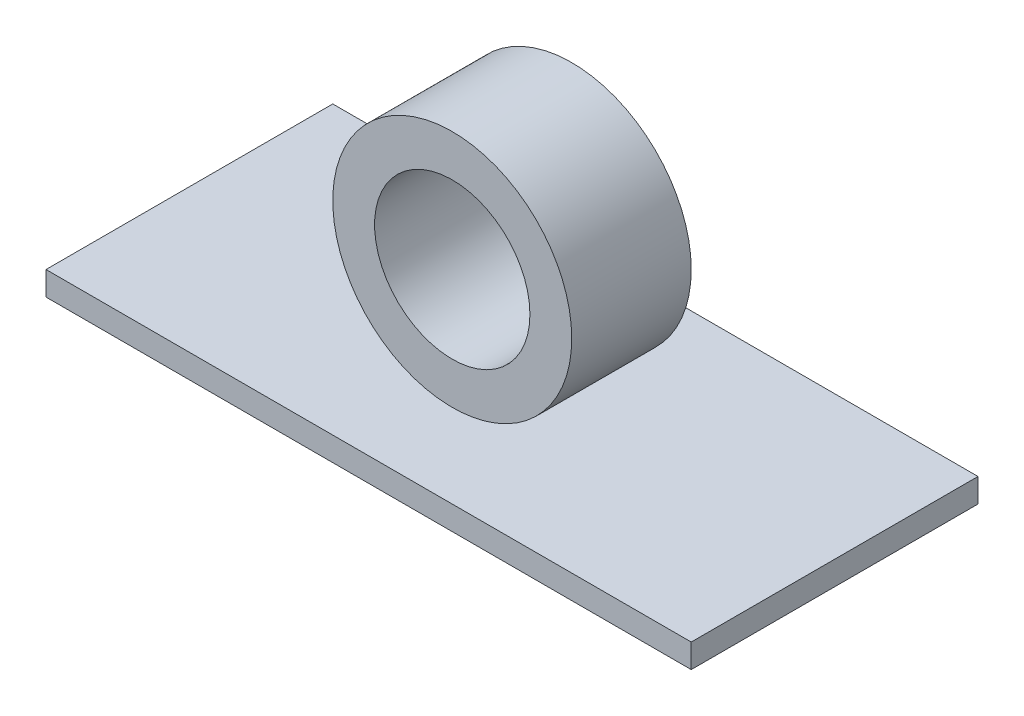
ISO-10303-21;
HEADER;
FILE_DESCRIPTION(('STEP AP214'),'2;1');
FILE_NAME('part.step','',(''),(''),'','','');
FILE_SCHEMA(('AUTOMOTIVE_DESIGN { 1 0 10303 214 1 1 1 1 }'));
ENDSEC;
DATA;
#1=APPLICATION_CONTEXT('core data for automotive mechanical design processes');
#2=APPLICATION_PROTOCOL_DEFINITION('international standard','automotive_design',2000,#1);
#3=PRODUCT_CONTEXT('',#1,'mechanical');
#4=PRODUCT('Part','Part','',(#3));
#5=PRODUCT_RELATED_PRODUCT_CATEGORY('part','',(#4));
#6=PRODUCT_DEFINITION_FORMATION('','',#4);
#7=PRODUCT_DEFINITION_CONTEXT('part definition',#1,'design');
#8=PRODUCT_DEFINITION('design','',#6,#7);
#9=PRODUCT_DEFINITION_SHAPE('','',#8);
#10=(LENGTH_UNIT() NAMED_UNIT(*) SI_UNIT(.MILLI.,.METRE.));
#11=(NAMED_UNIT(*) PLANE_ANGLE_UNIT() SI_UNIT($,.RADIAN.));
#12=(NAMED_UNIT(*) SI_UNIT($,.STERADIAN.) SOLID_ANGLE_UNIT());
#13=UNCERTAINTY_MEASURE_WITH_UNIT(LENGTH_MEASURE(1.E-05),#10,'distance_accuracy_value','');
#14=(GEOMETRIC_REPRESENTATION_CONTEXT(3) GLOBAL_UNCERTAINTY_ASSIGNED_CONTEXT((#13)) GLOBAL_UNIT_ASSIGNED_CONTEXT((#10,
#11,#12)) REPRESENTATION_CONTEXT('',''));
#15=CARTESIAN_POINT('',(0.,0.,0.));
#16=DIRECTION('',(0.,0.,1.));
#17=DIRECTION('',(1.,0.,0.));
#18=AXIS2_PLACEMENT_3D('',#15,#16,#17);
#19=CARTESIAN_POINT('',(0.,12.,5.));
#20=DIRECTION('',(0.,0.,1.));
#21=DIRECTION('',(1.,0.,0.));
#22=AXIS2_PLACEMENT_3D('',#19,#20,#21);
#23=PLANE('',#22);
#24=CARTESIAN_POINT('',(0.,12.,5.));
#25=DIRECTION('',(0.,0.,1.));
#26=DIRECTION('',(1.,0.,0.));
#27=AXIS2_PLACEMENT_3D('',#24,#25,#26);
#28=CIRCLE('',#27,10.);
#29=CARTESIAN_POINT('',(10.,12.,5.));
#30=VERTEX_POINT('',#29);
#31=EDGE_CURVE('E11',#30,#30,#28,.T.);
#32=ORIENTED_EDGE('',*,*,#31,.T.);
#33=EDGE_LOOP('',(#32));
#34=FACE_BOUND('',#33,.T.);
#35=CARTESIAN_POINT('',(0.,12.,5.));
#36=DIRECTION('',(0.,0.,1.));
#37=DIRECTION('',(1.,0.,0.));
#38=AXIS2_PLACEMENT_3D('',#35,#36,#37);
#39=CIRCLE('',#38,6.5);
#40=CARTESIAN_POINT('',(6.5,12.,5.));
#41=VERTEX_POINT('',#40);
#42=EDGE_CURVE('E52',#41,#41,#39,.T.);
#43=ORIENTED_EDGE('',*,*,#42,.F.);
#44=EDGE_LOOP('',(#43));
#45=FACE_BOUND('',#44,.T.);
#46=ADVANCED_FACE('F41',(#34,#45),#23,.T.);
#47=CARTESIAN_POINT('',(0.,12.,-5.));
#48=DIRECTION('',(0.,0.,1.));
#49=DIRECTION('',(1.,0.,0.));
#50=AXIS2_PLACEMENT_3D('',#47,#48,#49);
#51=PLANE('',#50);
#52=CARTESIAN_POINT('',(0.,12.,-5.));
#53=DIRECTION('',(0.,0.,1.));
#54=DIRECTION('',(1.,0.,0.));
#55=AXIS2_PLACEMENT_3D('',#52,#53,#54);
#56=CIRCLE('',#55,10.);
#57=CARTESIAN_POINT('',(10.,12.,-5.));
#58=VERTEX_POINT('',#57);
#59=EDGE_CURVE('E45',#58,#58,#56,.T.);
#60=ORIENTED_EDGE('',*,*,#59,.F.);
#61=EDGE_LOOP('',(#60));
#62=FACE_BOUND('',#61,.T.);
#63=CARTESIAN_POINT('',(0.,12.,-5.));
#64=DIRECTION('',(0.,0.,1.));
#65=DIRECTION('',(1.,0.,0.));
#66=AXIS2_PLACEMENT_3D('',#63,#64,#65);
#67=CIRCLE('',#66,6.5);
#68=CARTESIAN_POINT('',(6.5,12.,-5.));
#69=VERTEX_POINT('',#68);
#70=EDGE_CURVE('E54',#69,#69,#67,.T.);
#71=ORIENTED_EDGE('',*,*,#70,.T.);
#72=EDGE_LOOP('',(#71));
#73=FACE_BOUND('',#72,.T.);
#74=ADVANCED_FACE('F64',(#62,#73),#51,.F.);
#75=CARTESIAN_POINT('',(0.,12.,5.));
#76=DIRECTION('',(0.,0.,-1.));
#77=DIRECTION('',(-1.,0.,0.));
#78=AXIS2_PLACEMENT_3D('',#75,#76,#77);
#79=CYLINDRICAL_SURFACE('',#78,10.);
#80=ORIENTED_EDGE('',*,*,#31,.F.);
#81=EDGE_LOOP('',(#80));
#82=FACE_BOUND('',#81,.T.);
#83=ORIENTED_EDGE('',*,*,#59,.T.);
#84=EDGE_LOOP('',(#83));
#85=FACE_BOUND('',#84,.T.);
#86=ADVANCED_FACE('F43',(#82,#85),#79,.T.);
#87=CARTESIAN_POINT('',(0.,12.,5.));
#88=DIRECTION('',(0.,0.,-1.));
#89=DIRECTION('',(-1.,0.,0.));
#90=AXIS2_PLACEMENT_3D('',#87,#88,#89);
#91=CYLINDRICAL_SURFACE('',#90,6.5);
#92=ORIENTED_EDGE('',*,*,#42,.T.);
#93=EDGE_LOOP('',(#92));
#94=FACE_BOUND('',#93,.T.);
#95=ORIENTED_EDGE('',*,*,#70,.F.);
#96=EDGE_LOOP('',(#95));
#97=FACE_BOUND('',#96,.T.);
#98=ADVANCED_FACE('F60',(#94,#97),#91,.F.);
#99=CLOSED_SHELL('',(#46,#74,#86,#98));
#100=MANIFOLD_SOLID_BREP('B2',#99);
#101=CARTESIAN_POINT('',(27.,2.,12.));
#102=DIRECTION('',(-1.,0.,0.));
#103=DIRECTION('',(0.,0.,1.));
#104=AXIS2_PLACEMENT_3D('',#101,#102,#103);
#105=PLANE('',#104);
#106=DIRECTION('',(0.,0.,-1.));
#107=VECTOR('',#106,1.);
#108=CARTESIAN_POINT('',(27.,0.,12.));
#109=LINE('',#108,#107);
#110=CARTESIAN_POINT('',(27.,0.,12.));
#111=VERTEX_POINT('',#110);
#112=CARTESIAN_POINT('',(27.,0.,-12.));
#113=VERTEX_POINT('',#112);
#114=EDGE_CURVE('E166',#111,#113,#109,.T.);
#115=ORIENTED_EDGE('',*,*,#114,.T.);
#116=DIRECTION('',(0.,-1.,0.));
#117=VECTOR('',#116,1.);
#118=CARTESIAN_POINT('',(27.,2.,-12.));
#119=LINE('',#118,#117);
#120=CARTESIAN_POINT('',(27.,2.,-12.));
#121=VERTEX_POINT('',#120);
#122=EDGE_CURVE('E39',#121,#113,#119,.T.);
#123=ORIENTED_EDGE('',*,*,#122,.F.);
#124=DIRECTION('',(0.,0.,-1.));
#125=VECTOR('',#124,1.);
#126=CARTESIAN_POINT('',(27.,2.,12.));
#127=LINE('',#126,#125);
#128=CARTESIAN_POINT('',(27.,2.,12.));
#129=VERTEX_POINT('',#128);
#130=EDGE_CURVE('E154',#129,#121,#127,.T.);
#131=ORIENTED_EDGE('',*,*,#130,.F.);
#132=DIRECTION('',(0.,-1.,0.));
#133=VECTOR('',#132,1.);
#134=CARTESIAN_POINT('',(27.,2.,12.));
#135=LINE('',#134,#133);
#136=EDGE_CURVE('E162',#129,#111,#135,.T.);
#137=ORIENTED_EDGE('',*,*,#136,.T.);
#138=EDGE_LOOP('',(#115,#123,#131,#137));
#139=FACE_BOUND('',#138,.T.);
#140=ADVANCED_FACE('F103',(#139),#105,.F.);
#141=CARTESIAN_POINT('',(-27.,2.,-12.));
#142=DIRECTION('',(0.,0.,1.));
#143=DIRECTION('',(1.,0.,0.));
#144=AXIS2_PLACEMENT_3D('',#141,#142,#143);
#145=PLANE('',#144);
#146=DIRECTION('',(-1.,0.,0.));
#147=VECTOR('',#146,1.);
#148=CARTESIAN_POINT('',(-27.,0.,-12.));
#149=LINE('',#148,#147);
#150=CARTESIAN_POINT('',(-27.,0.,-12.));
#151=VERTEX_POINT('',#150);
#152=EDGE_CURVE('E158',#113,#151,#149,.T.);
#153=ORIENTED_EDGE('',*,*,#152,.T.);
#154=DIRECTION('',(0.,-1.,0.));
#155=VECTOR('',#154,1.);
#156=CARTESIAN_POINT('',(-27.,2.,-12.));
#157=LINE('',#156,#155);
#158=CARTESIAN_POINT('',(-27.,2.,-12.));
#159=VERTEX_POINT('',#158);
#160=EDGE_CURVE('E111',#159,#151,#157,.T.);
#161=ORIENTED_EDGE('',*,*,#160,.F.);
#162=DIRECTION('',(-1.,0.,0.));
#163=VECTOR('',#162,1.);
#164=CARTESIAN_POINT('',(-27.,2.,-12.));
#165=LINE('',#164,#163);
#166=EDGE_CURVE('E149',#121,#159,#165,.T.);
#167=ORIENTED_EDGE('',*,*,#166,.F.);
#168=ORIENTED_EDGE('',*,*,#122,.T.);
#169=EDGE_LOOP('',(#153,#161,#167,#168));
#170=FACE_BOUND('',#169,.T.);
#171=ADVANCED_FACE('F157',(#170),#145,.F.);
#172=CARTESIAN_POINT('',(-27.,2.,12.));
#173=DIRECTION('',(1.,0.,0.));
#174=DIRECTION('',(0.,0.,-1.));
#175=AXIS2_PLACEMENT_3D('',#172,#173,#174);
#176=PLANE('',#175);
#177=DIRECTION('',(0.,0.,1.));
#178=VECTOR('',#177,1.);
#179=CARTESIAN_POINT('',(-27.,0.,12.));
#180=LINE('',#179,#178);
#181=CARTESIAN_POINT('',(-27.,0.,12.));
#182=VERTEX_POINT('',#181);
#183=EDGE_CURVE('E136',#151,#182,#180,.T.);
#184=ORIENTED_EDGE('',*,*,#183,.T.);
#185=DIRECTION('',(0.,-1.,0.));
#186=VECTOR('',#185,1.);
#187=CARTESIAN_POINT('',(-27.,2.,12.));
#188=LINE('',#187,#186);
#189=CARTESIAN_POINT('',(-27.,2.,12.));
#190=VERTEX_POINT('',#189);
#191=EDGE_CURVE('E159',#190,#182,#188,.T.);
#192=ORIENTED_EDGE('',*,*,#191,.F.);
#193=DIRECTION('',(0.,0.,1.));
#194=VECTOR('',#193,1.);
#195=CARTESIAN_POINT('',(-27.,2.,12.));
#196=LINE('',#195,#194);
#197=EDGE_CURVE('E152',#159,#190,#196,.T.);
#198=ORIENTED_EDGE('',*,*,#197,.F.);
#199=ORIENTED_EDGE('',*,*,#160,.T.);
#200=EDGE_LOOP('',(#184,#192,#198,#199));
#201=FACE_BOUND('',#200,.T.);
#202=ADVANCED_FACE('F160',(#201),#176,.F.);
#203=CARTESIAN_POINT('',(-27.,2.,12.));
#204=DIRECTION('',(0.,0.,-1.));
#205=DIRECTION('',(-1.,0.,0.));
#206=AXIS2_PLACEMENT_3D('',#203,#204,#205);
#207=PLANE('',#206);
#208=DIRECTION('',(1.,0.,0.));
#209=VECTOR('',#208,1.);
#210=CARTESIAN_POINT('',(-27.,0.,12.));
#211=LINE('',#210,#209);
#212=EDGE_CURVE('E142',#182,#111,#211,.T.);
#213=ORIENTED_EDGE('',*,*,#212,.T.);
#214=ORIENTED_EDGE('',*,*,#136,.F.);
#215=DIRECTION('',(1.,0.,0.));
#216=VECTOR('',#215,1.);
#217=CARTESIAN_POINT('',(-27.,2.,12.));
#218=LINE('',#217,#216);
#219=EDGE_CURVE('E119',#190,#129,#218,.T.);
#220=ORIENTED_EDGE('',*,*,#219,.F.);
#221=ORIENTED_EDGE('',*,*,#191,.T.);
#222=EDGE_LOOP('',(#213,#214,#220,#221));
#223=FACE_BOUND('',#222,.T.);
#224=ADVANCED_FACE('F173',(#223),#207,.F.);
#225=CARTESIAN_POINT('',(0.,2.,0.));
#226=DIRECTION('',(0.,-1.,0.));
#227=DIRECTION('',(0.,0.,-1.));
#228=AXIS2_PLACEMENT_3D('',#225,#226,#227);
#229=PLANE('',#228);
#230=ORIENTED_EDGE('',*,*,#130,.T.);
#231=ORIENTED_EDGE('',*,*,#166,.T.);
#232=ORIENTED_EDGE('',*,*,#197,.T.);
#233=ORIENTED_EDGE('',*,*,#219,.T.);
#234=EDGE_LOOP('',(#230,#231,#232,#233));
#235=FACE_BOUND('',#234,.T.);
#236=ADVANCED_FACE('F150',(#235),#229,.F.);
#237=CARTESIAN_POINT('',(0.,0.,0.));
#238=DIRECTION('',(0.,-1.,0.));
#239=DIRECTION('',(0.,0.,-1.));
#240=AXIS2_PLACEMENT_3D('',#237,#238,#239);
#241=PLANE('',#240);
#242=ORIENTED_EDGE('',*,*,#114,.F.);
#243=ORIENTED_EDGE('',*,*,#212,.F.);
#244=ORIENTED_EDGE('',*,*,#183,.F.);
#245=ORIENTED_EDGE('',*,*,#152,.F.);
#246=EDGE_LOOP('',(#242,#243,#244,#245));
#247=FACE_BOUND('',#246,.T.);
#248=ADVANCED_FACE('F176',(#247),#241,.T.);
#249=CLOSED_SHELL('',(#140,#171,#202,#224,#236,#248));
#250=MANIFOLD_SOLID_BREP('B6',#249);
#251=ADVANCED_BREP_SHAPE_REPRESENTATION('',(#18,#100,#250),#14);
#252=SHAPE_DEFINITION_REPRESENTATION(#9,#251);
ENDSEC;
END-ISO-10303-21;
